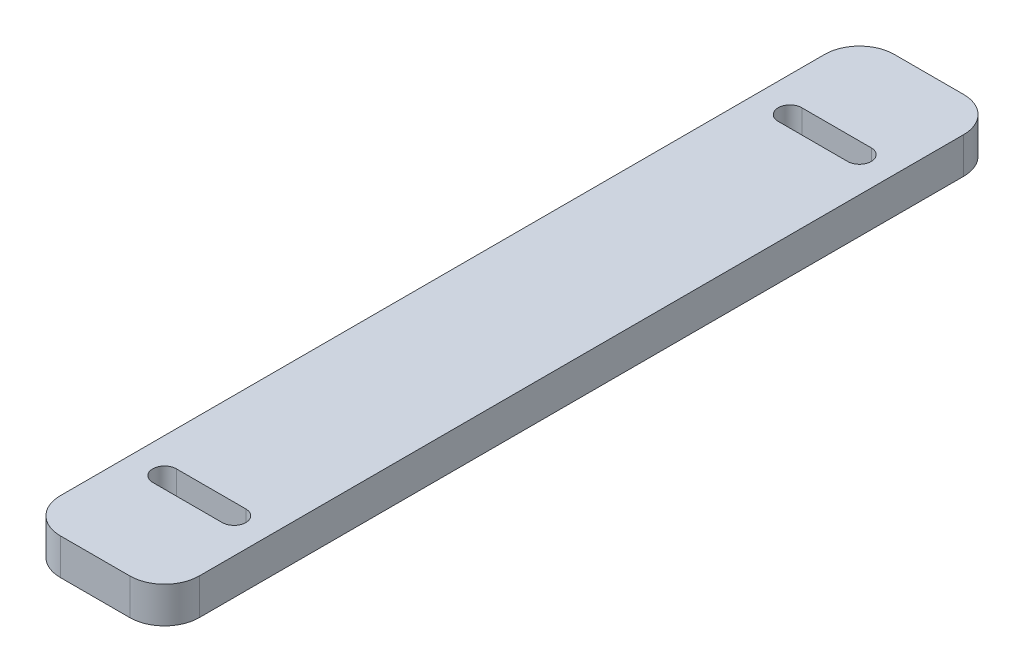
ISO-10303-21;
HEADER;
FILE_DESCRIPTION(('STEP AP214'),'2;1');
FILE_NAME('part.step','',(''),(''),'','','');
FILE_SCHEMA(('AUTOMOTIVE_DESIGN { 1 0 10303 214 1 1 1 1 }'));
ENDSEC;
DATA;
#1=APPLICATION_CONTEXT('core data for automotive mechanical design processes');
#2=APPLICATION_PROTOCOL_DEFINITION('international standard','automotive_design',2000,#1);
#3=PRODUCT_CONTEXT('',#1,'mechanical');
#4=PRODUCT('Part','Part','',(#3));
#5=PRODUCT_RELATED_PRODUCT_CATEGORY('part','',(#4));
#6=PRODUCT_DEFINITION_FORMATION('','',#4);
#7=PRODUCT_DEFINITION_CONTEXT('part definition',#1,'design');
#8=PRODUCT_DEFINITION('design','',#6,#7);
#9=PRODUCT_DEFINITION_SHAPE('','',#8);
#10=(LENGTH_UNIT() NAMED_UNIT(*) SI_UNIT(.MILLI.,.METRE.));
#11=(NAMED_UNIT(*) PLANE_ANGLE_UNIT() SI_UNIT($,.RADIAN.));
#12=(NAMED_UNIT(*) SI_UNIT($,.STERADIAN.) SOLID_ANGLE_UNIT());
#13=UNCERTAINTY_MEASURE_WITH_UNIT(LENGTH_MEASURE(1.E-05),#10,'distance_accuracy_value','');
#14=(GEOMETRIC_REPRESENTATION_CONTEXT(3) GLOBAL_UNCERTAINTY_ASSIGNED_CONTEXT((#13)) GLOBAL_UNIT_ASSIGNED_CONTEXT((#10,
#11,#12)) REPRESENTATION_CONTEXT('',''));
#15=CARTESIAN_POINT('',(0.,0.,0.));
#16=DIRECTION('',(0.,0.,1.));
#17=DIRECTION('',(1.,0.,0.));
#18=AXIS2_PLACEMENT_3D('',#15,#16,#17);
#19=CARTESIAN_POINT('',(-12.7,6.604,-76.2));
#20=DIRECTION('',(1.,0.,0.));
#21=DIRECTION('',(0.,0.,-1.));
#22=AXIS2_PLACEMENT_3D('',#19,#20,#21);
#23=PLANE('',#22);
#24=DIRECTION('',(0.,0.,1.));
#25=VECTOR('',#24,1.);
#26=CARTESIAN_POINT('',(-12.7,0.,-76.2));
#27=LINE('',#26,#25);
#28=CARTESIAN_POINT('',(-12.7,0.,-69.85));
#29=VERTEX_POINT('',#28);
#30=CARTESIAN_POINT('',(-12.7,0.,69.85));
#31=VERTEX_POINT('',#30);
#32=EDGE_CURVE('E214',#29,#31,#27,.T.);
#33=ORIENTED_EDGE('',*,*,#32,.T.);
#34=DIRECTION('',(0.,-1.,0.));
#35=VECTOR('',#34,1.);
#36=CARTESIAN_POINT('',(-12.7,6.604,69.85));
#37=LINE('',#36,#35);
#38=CARTESIAN_POINT('',(-12.7,6.604,69.85));
#39=VERTEX_POINT('',#38);
#40=EDGE_CURVE('E257',#31,#39,#37,.F.);
#41=ORIENTED_EDGE('',*,*,#40,.T.);
#42=DIRECTION('',(0.,0.,1.));
#43=VECTOR('',#42,1.);
#44=CARTESIAN_POINT('',(-12.7,6.604,-76.2));
#45=LINE('',#44,#43);
#46=CARTESIAN_POINT('',(-12.7,6.604,-69.85));
#47=VERTEX_POINT('',#46);
#48=EDGE_CURVE('E221',#47,#39,#45,.T.);
#49=ORIENTED_EDGE('',*,*,#48,.F.);
#50=DIRECTION('',(0.,-1.,0.));
#51=VECTOR('',#50,1.);
#52=CARTESIAN_POINT('',(-12.7,6.604,-69.85));
#53=LINE('',#52,#51);
#54=EDGE_CURVE('E254',#47,#29,#53,.T.);
#55=ORIENTED_EDGE('',*,*,#54,.T.);
#56=EDGE_LOOP('',(#33,#41,#49,#55));
#57=FACE_BOUND('',#56,.T.);
#58=ADVANCED_FACE('F32',(#57),#23,.F.);
#59=CARTESIAN_POINT('',(-12.7,6.604,76.2));
#60=DIRECTION('',(0.,0.,-1.));
#61=DIRECTION('',(-1.,0.,0.));
#62=AXIS2_PLACEMENT_3D('',#59,#60,#61);
#63=PLANE('',#62);
#64=DIRECTION('',(1.,0.,0.));
#65=VECTOR('',#64,1.);
#66=CARTESIAN_POINT('',(-12.7,6.604,76.2));
#67=LINE('',#66,#65);
#68=CARTESIAN_POINT('',(-6.34999999999999,6.604,76.2));
#69=VERTEX_POINT('',#68);
#70=CARTESIAN_POINT('',(6.35000000000001,6.604,76.2));
#71=VERTEX_POINT('',#70);
#72=EDGE_CURVE('E224',#69,#71,#67,.T.);
#73=ORIENTED_EDGE('',*,*,#72,.F.);
#74=DIRECTION('',(0.,-1.,0.));
#75=VECTOR('',#74,1.);
#76=CARTESIAN_POINT('',(-6.34999999999999,6.604,76.2));
#77=LINE('',#76,#75);
#78=CARTESIAN_POINT('',(-6.34999999999999,0.,76.2));
#79=VERTEX_POINT('',#78);
#80=EDGE_CURVE('E243',#69,#79,#77,.T.);
#81=ORIENTED_EDGE('',*,*,#80,.T.);
#82=DIRECTION('',(1.,0.,0.));
#83=VECTOR('',#82,1.);
#84=CARTESIAN_POINT('',(-12.7,0.,76.2));
#85=LINE('',#84,#83);
#86=CARTESIAN_POINT('',(6.35000000000001,0.,76.2));
#87=VERTEX_POINT('',#86);
#88=EDGE_CURVE('E235',#79,#87,#85,.T.);
#89=ORIENTED_EDGE('',*,*,#88,.T.);
#90=DIRECTION('',(0.,-1.,0.));
#91=VECTOR('',#90,1.);
#92=CARTESIAN_POINT('',(6.35000000000001,6.604,76.2));
#93=LINE('',#92,#91);
#94=EDGE_CURVE('E232',#87,#71,#93,.F.);
#95=ORIENTED_EDGE('',*,*,#94,.T.);
#96=EDGE_LOOP('',(#73,#81,#89,#95));
#97=FACE_BOUND('',#96,.T.);
#98=ADVANCED_FACE('F293',(#97),#63,.F.);
#99=CARTESIAN_POINT('',(12.7,6.604,-76.2));
#100=DIRECTION('',(-1.,0.,0.));
#101=DIRECTION('',(0.,0.,1.));
#102=AXIS2_PLACEMENT_3D('',#99,#100,#101);
#103=PLANE('',#102);
#104=DIRECTION('',(0.,0.,-1.));
#105=VECTOR('',#104,1.);
#106=CARTESIAN_POINT('',(12.7,6.604,-76.2));
#107=LINE('',#106,#105);
#108=CARTESIAN_POINT('',(12.7,6.604,69.85));
#109=VERTEX_POINT('',#108);
#110=CARTESIAN_POINT('',(12.7,6.604,-69.85));
#111=VERTEX_POINT('',#110);
#112=EDGE_CURVE('E228',#109,#111,#107,.T.);
#113=ORIENTED_EDGE('',*,*,#112,.F.);
#114=DIRECTION('',(0.,-1.,0.));
#115=VECTOR('',#114,1.);
#116=CARTESIAN_POINT('',(12.7,6.604,69.85));
#117=LINE('',#116,#115);
#118=CARTESIAN_POINT('',(12.7,0.,69.85));
#119=VERTEX_POINT('',#118);
#120=EDGE_CURVE('E268',#109,#119,#117,.T.);
#121=ORIENTED_EDGE('',*,*,#120,.T.);
#122=DIRECTION('',(0.,0.,-1.));
#123=VECTOR('',#122,1.);
#124=CARTESIAN_POINT('',(12.7,0.,-76.2));
#125=LINE('',#124,#123);
#126=CARTESIAN_POINT('',(12.7,0.,-69.85));
#127=VERTEX_POINT('',#126);
#128=EDGE_CURVE('E238',#119,#127,#125,.T.);
#129=ORIENTED_EDGE('',*,*,#128,.T.);
#130=DIRECTION('',(0.,-1.,0.));
#131=VECTOR('',#130,1.);
#132=CARTESIAN_POINT('',(12.7,6.604,-69.85));
#133=LINE('',#132,#131);
#134=EDGE_CURVE('E266',#127,#111,#133,.F.);
#135=ORIENTED_EDGE('',*,*,#134,.T.);
#136=EDGE_LOOP('',(#113,#121,#129,#135));
#137=FACE_BOUND('',#136,.T.);
#138=ADVANCED_FACE('F301',(#137),#103,.F.);
#139=CARTESIAN_POINT('',(-12.7,6.604,-76.2));
#140=DIRECTION('',(0.,0.,1.));
#141=DIRECTION('',(1.,0.,0.));
#142=AXIS2_PLACEMENT_3D('',#139,#140,#141);
#143=PLANE('',#142);
#144=DIRECTION('',(-1.,0.,0.));
#145=VECTOR('',#144,1.);
#146=CARTESIAN_POINT('',(-12.7,0.,-76.2));
#147=LINE('',#146,#145);
#148=CARTESIAN_POINT('',(6.34999999999999,0.,-76.2));
#149=VERTEX_POINT('',#148);
#150=CARTESIAN_POINT('',(-6.35000000000001,0.,-76.2));
#151=VERTEX_POINT('',#150);
#152=EDGE_CURVE('E225',#149,#151,#147,.T.);
#153=ORIENTED_EDGE('',*,*,#152,.T.);
#154=DIRECTION('',(0.,-1.,0.));
#155=VECTOR('',#154,1.);
#156=CARTESIAN_POINT('',(-6.35000000000001,6.604,-76.2));
#157=LINE('',#156,#155);
#158=CARTESIAN_POINT('',(-6.35000000000001,6.604,-76.2));
#159=VERTEX_POINT('',#158);
#160=EDGE_CURVE('E11',#151,#159,#157,.F.);
#161=ORIENTED_EDGE('',*,*,#160,.T.);
#162=DIRECTION('',(-1.,0.,0.));
#163=VECTOR('',#162,1.);
#164=CARTESIAN_POINT('',(-12.7,6.604,-76.2));
#165=LINE('',#164,#163);
#166=CARTESIAN_POINT('',(6.34999999999999,6.604,-76.2));
#167=VERTEX_POINT('',#166);
#168=EDGE_CURVE('E230',#167,#159,#165,.T.);
#169=ORIENTED_EDGE('',*,*,#168,.F.);
#170=DIRECTION('',(0.,-1.,0.));
#171=VECTOR('',#170,1.);
#172=CARTESIAN_POINT('',(6.34999999999999,6.604,-76.2));
#173=LINE('',#172,#171);
#174=EDGE_CURVE('E40',#167,#149,#173,.T.);
#175=ORIENTED_EDGE('',*,*,#174,.T.);
#176=EDGE_LOOP('',(#153,#161,#169,#175));
#177=FACE_BOUND('',#176,.T.);
#178=ADVANCED_FACE('F273',(#177),#143,.F.);
#179=CARTESIAN_POINT('',(0.,6.604,0.));
#180=DIRECTION('',(0.,1.,0.));
#181=DIRECTION('',(0.,0.,1.));
#182=AXIS2_PLACEMENT_3D('',#179,#180,#181);
#183=PLANE('',#182);
#184=CARTESIAN_POINT('',(-6.34999999999999,6.604,57.15));
#185=DIRECTION('',(0.,1.,0.));
#186=DIRECTION('',(0.,0.,1.));
#187=AXIS2_PLACEMENT_3D('',#184,#185,#186);
#188=CIRCLE('',#187,2.159);
#189=CARTESIAN_POINT('',(-6.34999999999999,6.604,54.991));
#190=VERTEX_POINT('',#189);
#191=CARTESIAN_POINT('',(-6.34999999999999,6.604,59.309));
#192=VERTEX_POINT('',#191);
#193=EDGE_CURVE('E152',#190,#192,#188,.T.);
#194=ORIENTED_EDGE('',*,*,#193,.F.);
#195=DIRECTION('',(-1.,0.,0.));
#196=VECTOR('',#195,1.);
#197=CARTESIAN_POINT('',(-6.34999999999999,6.604,54.991));
#198=LINE('',#197,#196);
#199=CARTESIAN_POINT('',(6.35000000000001,6.604,54.991));
#200=VERTEX_POINT('',#199);
#201=EDGE_CURVE('E170',#200,#190,#198,.T.);
#202=ORIENTED_EDGE('',*,*,#201,.F.);
#203=CARTESIAN_POINT('',(6.35000000000001,6.604,57.15));
#204=DIRECTION('',(0.,1.,0.));
#205=DIRECTION('',(0.,0.,1.));
#206=AXIS2_PLACEMENT_3D('',#203,#204,#205);
#207=CIRCLE('',#206,2.159);
#208=CARTESIAN_POINT('',(6.35000000000001,6.604,59.309));
#209=VERTEX_POINT('',#208);
#210=EDGE_CURVE('E173',#209,#200,#207,.T.);
#211=ORIENTED_EDGE('',*,*,#210,.F.);
#212=DIRECTION('',(1.,0.,0.));
#213=VECTOR('',#212,1.);
#214=CARTESIAN_POINT('',(-6.34999999999999,6.604,59.309));
#215=LINE('',#214,#213);
#216=EDGE_CURVE('E179',#192,#209,#215,.T.);
#217=ORIENTED_EDGE('',*,*,#216,.F.);
#218=EDGE_LOOP('',(#194,#202,#211,#217));
#219=FACE_BOUND('',#218,.T.);
#220=CARTESIAN_POINT('',(-6.35,6.604,-57.15));
#221=DIRECTION('',(0.,1.,0.));
#222=DIRECTION('',(0.,0.,1.));
#223=AXIS2_PLACEMENT_3D('',#220,#221,#222);
#224=CIRCLE('',#223,2.159);
#225=CARTESIAN_POINT('',(-6.35,6.604,-59.309));
#226=VERTEX_POINT('',#225);
#227=CARTESIAN_POINT('',(-6.35,6.604,-54.991));
#228=VERTEX_POINT('',#227);
#229=EDGE_CURVE('E185',#226,#228,#224,.T.);
#230=ORIENTED_EDGE('',*,*,#229,.F.);
#231=DIRECTION('',(-1.,0.,0.));
#232=VECTOR('',#231,1.);
#233=CARTESIAN_POINT('',(-6.35,6.604,-59.309));
#234=LINE('',#233,#232);
#235=CARTESIAN_POINT('',(6.35,6.604,-59.309));
#236=VERTEX_POINT('',#235);
#237=EDGE_CURVE('E193',#236,#226,#234,.T.);
#238=ORIENTED_EDGE('',*,*,#237,.F.);
#239=CARTESIAN_POINT('',(6.35,6.604,-57.15));
#240=DIRECTION('',(0.,1.,0.));
#241=DIRECTION('',(0.,0.,1.));
#242=AXIS2_PLACEMENT_3D('',#239,#240,#241);
#243=CIRCLE('',#242,2.159);
#244=CARTESIAN_POINT('',(6.35,6.604,-54.991));
#245=VERTEX_POINT('',#244);
#246=EDGE_CURVE('E207',#245,#236,#243,.T.);
#247=ORIENTED_EDGE('',*,*,#246,.F.);
#248=DIRECTION('',(1.,0.,0.));
#249=VECTOR('',#248,1.);
#250=CARTESIAN_POINT('',(-6.35,6.604,-54.991));
#251=LINE('',#250,#249);
#252=EDGE_CURVE('E204',#228,#245,#251,.T.);
#253=ORIENTED_EDGE('',*,*,#252,.F.);
#254=EDGE_LOOP('',(#230,#238,#247,#253));
#255=FACE_BOUND('',#254,.T.);
#256=ORIENTED_EDGE('',*,*,#48,.T.);
#257=CARTESIAN_POINT('',(-6.34999999999999,6.604,69.85));
#258=DIRECTION('',(0.,1.,0.));
#259=DIRECTION('',(0.,0.,1.));
#260=AXIS2_PLACEMENT_3D('',#257,#258,#259);
#261=CIRCLE('',#260,6.35);
#262=EDGE_CURVE('E264',#39,#69,#261,.T.);
#263=ORIENTED_EDGE('',*,*,#262,.T.);
#264=ORIENTED_EDGE('',*,*,#72,.T.);
#265=CARTESIAN_POINT('',(6.35000000000001,6.604,69.85));
#266=DIRECTION('',(0.,1.,0.));
#267=DIRECTION('',(0.,0.,1.));
#268=AXIS2_PLACEMENT_3D('',#265,#266,#267);
#269=CIRCLE('',#268,6.35);
#270=EDGE_CURVE('E262',#71,#109,#269,.T.);
#271=ORIENTED_EDGE('',*,*,#270,.T.);
#272=ORIENTED_EDGE('',*,*,#112,.T.);
#273=CARTESIAN_POINT('',(6.34999999999999,6.604,-69.85));
#274=DIRECTION('',(0.,1.,0.));
#275=DIRECTION('',(0.,0.,1.));
#276=AXIS2_PLACEMENT_3D('',#273,#274,#275);
#277=CIRCLE('',#276,6.35);
#278=EDGE_CURVE('E52',#111,#167,#277,.T.);
#279=ORIENTED_EDGE('',*,*,#278,.T.);
#280=ORIENTED_EDGE('',*,*,#168,.T.);
#281=CARTESIAN_POINT('',(-6.35000000000001,6.604,-69.85));
#282=DIRECTION('',(0.,1.,0.));
#283=DIRECTION('',(0.,0.,1.));
#284=AXIS2_PLACEMENT_3D('',#281,#282,#283);
#285=CIRCLE('',#284,6.35);
#286=EDGE_CURVE('E260',#159,#47,#285,.T.);
#287=ORIENTED_EDGE('',*,*,#286,.T.);
#288=EDGE_LOOP('',(#256,#263,#264,#271,#272,#279,#280,#287));
#289=FACE_BOUND('',#288,.T.);
#290=ADVANCED_FACE('F287',(#219,#255,#289),#183,.T.);
#291=CARTESIAN_POINT('',(0.,0.,0.));
#292=DIRECTION('',(0.,1.,0.));
#293=DIRECTION('',(0.,0.,1.));
#294=AXIS2_PLACEMENT_3D('',#291,#292,#293);
#295=PLANE('',#294);
#296=DIRECTION('',(-1.,0.,0.));
#297=VECTOR('',#296,1.);
#298=CARTESIAN_POINT('',(-6.34999999999999,0.,54.991));
#299=LINE('',#298,#297);
#300=CARTESIAN_POINT('',(6.35000000000001,0.,54.991));
#301=VERTEX_POINT('',#300);
#302=CARTESIAN_POINT('',(-6.34999999999999,0.,54.991));
#303=VERTEX_POINT('',#302);
#304=EDGE_CURVE('E157',#301,#303,#299,.T.);
#305=ORIENTED_EDGE('',*,*,#304,.T.);
#306=CARTESIAN_POINT('',(-6.34999999999999,0.,57.15));
#307=DIRECTION('',(0.,1.,0.));
#308=DIRECTION('',(0.,0.,1.));
#309=AXIS2_PLACEMENT_3D('',#306,#307,#308);
#310=CIRCLE('',#309,2.159);
#311=CARTESIAN_POINT('',(-6.34999999999999,0.,59.309));
#312=VERTEX_POINT('',#311);
#313=EDGE_CURVE('E149',#303,#312,#310,.T.);
#314=ORIENTED_EDGE('',*,*,#313,.T.);
#315=DIRECTION('',(1.,0.,0.));
#316=VECTOR('',#315,1.);
#317=CARTESIAN_POINT('',(-6.34999999999999,0.,59.309));
#318=LINE('',#317,#316);
#319=CARTESIAN_POINT('',(6.35000000000001,0.,59.309));
#320=VERTEX_POINT('',#319);
#321=EDGE_CURVE('E161',#312,#320,#318,.T.);
#322=ORIENTED_EDGE('',*,*,#321,.T.);
#323=CARTESIAN_POINT('',(6.35000000000001,0.,57.15));
#324=DIRECTION('',(0.,1.,0.));
#325=DIRECTION('',(0.,0.,1.));
#326=AXIS2_PLACEMENT_3D('',#323,#324,#325);
#327=CIRCLE('',#326,2.159);
#328=EDGE_CURVE('E165',#320,#301,#327,.T.);
#329=ORIENTED_EDGE('',*,*,#328,.T.);
#330=EDGE_LOOP('',(#305,#314,#322,#329));
#331=FACE_BOUND('',#330,.T.);
#332=DIRECTION('',(-1.,0.,0.));
#333=VECTOR('',#332,1.);
#334=CARTESIAN_POINT('',(-6.35,0.,-59.309));
#335=LINE('',#334,#333);
#336=CARTESIAN_POINT('',(6.35,0.,-59.309));
#337=VERTEX_POINT('',#336);
#338=CARTESIAN_POINT('',(-6.35,0.,-59.309));
#339=VERTEX_POINT('',#338);
#340=EDGE_CURVE('E199',#337,#339,#335,.T.);
#341=ORIENTED_EDGE('',*,*,#340,.T.);
#342=CARTESIAN_POINT('',(-6.35,0.,-57.15));
#343=DIRECTION('',(0.,1.,0.));
#344=DIRECTION('',(0.,0.,1.));
#345=AXIS2_PLACEMENT_3D('',#342,#343,#344);
#346=CIRCLE('',#345,2.159);
#347=CARTESIAN_POINT('',(-6.35,0.,-54.991));
#348=VERTEX_POINT('',#347);
#349=EDGE_CURVE('E189',#339,#348,#346,.T.);
#350=ORIENTED_EDGE('',*,*,#349,.T.);
#351=DIRECTION('',(1.,0.,0.));
#352=VECTOR('',#351,1.);
#353=CARTESIAN_POINT('',(-6.35,0.,-54.991));
#354=LINE('',#353,#352);
#355=CARTESIAN_POINT('',(6.35,0.,-54.991));
#356=VERTEX_POINT('',#355);
#357=EDGE_CURVE('E192',#348,#356,#354,.T.);
#358=ORIENTED_EDGE('',*,*,#357,.T.);
#359=CARTESIAN_POINT('',(6.35,0.,-57.15));
#360=DIRECTION('',(0.,1.,0.));
#361=DIRECTION('',(0.,0.,1.));
#362=AXIS2_PLACEMENT_3D('',#359,#360,#361);
#363=CIRCLE('',#362,2.159);
#364=EDGE_CURVE('E196',#356,#337,#363,.T.);
#365=ORIENTED_EDGE('',*,*,#364,.T.);
#366=EDGE_LOOP('',(#341,#350,#358,#365));
#367=FACE_BOUND('',#366,.T.);
#368=ORIENTED_EDGE('',*,*,#88,.F.);
#369=CARTESIAN_POINT('',(-6.34999999999999,0.,69.85));
#370=DIRECTION('',(0.,1.,0.));
#371=DIRECTION('',(0.,0.,1.));
#372=AXIS2_PLACEMENT_3D('',#369,#370,#371);
#373=CIRCLE('',#372,6.35);
#374=EDGE_CURVE('E252',#79,#31,#373,.F.);
#375=ORIENTED_EDGE('',*,*,#374,.T.);
#376=ORIENTED_EDGE('',*,*,#32,.F.);
#377=CARTESIAN_POINT('',(-6.35000000000001,0.,-69.85));
#378=DIRECTION('',(0.,1.,0.));
#379=DIRECTION('',(0.,0.,1.));
#380=AXIS2_PLACEMENT_3D('',#377,#378,#379);
#381=CIRCLE('',#380,6.35);
#382=EDGE_CURVE('E248',#29,#151,#381,.F.);
#383=ORIENTED_EDGE('',*,*,#382,.T.);
#384=ORIENTED_EDGE('',*,*,#152,.F.);
#385=CARTESIAN_POINT('',(6.34999999999999,0.,-69.85));
#386=DIRECTION('',(0.,1.,0.));
#387=DIRECTION('',(0.,0.,1.));
#388=AXIS2_PLACEMENT_3D('',#385,#386,#387);
#389=CIRCLE('',#388,6.35);
#390=EDGE_CURVE('E246',#149,#127,#389,.F.);
#391=ORIENTED_EDGE('',*,*,#390,.T.);
#392=ORIENTED_EDGE('',*,*,#128,.F.);
#393=CARTESIAN_POINT('',(6.35000000000001,0.,69.85));
#394=DIRECTION('',(0.,1.,0.));
#395=DIRECTION('',(0.,0.,1.));
#396=AXIS2_PLACEMENT_3D('',#393,#394,#395);
#397=CIRCLE('',#396,6.35);
#398=EDGE_CURVE('E250',#119,#87,#397,.F.);
#399=ORIENTED_EDGE('',*,*,#398,.T.);
#400=EDGE_LOOP('',(#368,#375,#376,#383,#384,#391,#392,#399));
#401=FACE_BOUND('',#400,.T.);
#402=ADVANCED_FACE('F167',(#331,#367,#401),#295,.F.);
#403=CARTESIAN_POINT('',(-6.35,0.,-57.15));
#404=DIRECTION('',(0.,1.,0.));
#405=DIRECTION('',(0.,0.,1.));
#406=AXIS2_PLACEMENT_3D('',#403,#404,#405);
#407=CYLINDRICAL_SURFACE('',#406,2.159);
#408=ORIENTED_EDGE('',*,*,#229,.T.);
#409=DIRECTION('',(0.,1.,0.));
#410=VECTOR('',#409,1.);
#411=CARTESIAN_POINT('',(-6.35,0.,-54.991));
#412=LINE('',#411,#410);
#413=EDGE_CURVE('E202',#348,#228,#412,.T.);
#414=ORIENTED_EDGE('',*,*,#413,.F.);
#415=ORIENTED_EDGE('',*,*,#349,.F.);
#416=DIRECTION('',(0.,1.,0.));
#417=VECTOR('',#416,1.);
#418=CARTESIAN_POINT('',(-6.35,0.,-59.309));
#419=LINE('',#418,#417);
#420=EDGE_CURVE('E212',#339,#226,#419,.T.);
#421=ORIENTED_EDGE('',*,*,#420,.T.);
#422=EDGE_LOOP('',(#408,#414,#415,#421));
#423=FACE_BOUND('',#422,.T.);
#424=ADVANCED_FACE('F398',(#423),#407,.F.);
#425=CARTESIAN_POINT('',(-6.35,0.,-59.309));
#426=DIRECTION('',(0.,0.,-1.));
#427=DIRECTION('',(-1.,0.,0.));
#428=AXIS2_PLACEMENT_3D('',#425,#426,#427);
#429=PLANE('',#428);
#430=ORIENTED_EDGE('',*,*,#237,.T.);
#431=ORIENTED_EDGE('',*,*,#420,.F.);
#432=ORIENTED_EDGE('',*,*,#340,.F.);
#433=DIRECTION('',(0.,1.,0.));
#434=VECTOR('',#433,1.);
#435=CARTESIAN_POINT('',(6.35,0.,-59.309));
#436=LINE('',#435,#434);
#437=EDGE_CURVE('E215',#337,#236,#436,.T.);
#438=ORIENTED_EDGE('',*,*,#437,.T.);
#439=EDGE_LOOP('',(#430,#431,#432,#438));
#440=FACE_BOUND('',#439,.T.);
#441=ADVANCED_FACE('F389',(#440),#429,.F.);
#442=CARTESIAN_POINT('',(6.35,0.,-57.15));
#443=DIRECTION('',(0.,1.,0.));
#444=DIRECTION('',(0.,0.,1.));
#445=AXIS2_PLACEMENT_3D('',#442,#443,#444);
#446=CYLINDRICAL_SURFACE('',#445,2.159);
#447=ORIENTED_EDGE('',*,*,#246,.T.);
#448=ORIENTED_EDGE('',*,*,#437,.F.);
#449=ORIENTED_EDGE('',*,*,#364,.F.);
#450=DIRECTION('',(0.,1.,0.));
#451=VECTOR('',#450,1.);
#452=CARTESIAN_POINT('',(6.35,0.,-54.991));
#453=LINE('',#452,#451);
#454=EDGE_CURVE('E217',#356,#245,#453,.T.);
#455=ORIENTED_EDGE('',*,*,#454,.T.);
#456=EDGE_LOOP('',(#447,#448,#449,#455));
#457=FACE_BOUND('',#456,.T.);
#458=ADVANCED_FACE('F380',(#457),#446,.F.);
#459=CARTESIAN_POINT('',(-6.35,0.,-54.991));
#460=DIRECTION('',(0.,0.,1.));
#461=DIRECTION('',(1.,0.,0.));
#462=AXIS2_PLACEMENT_3D('',#459,#460,#461);
#463=PLANE('',#462);
#464=ORIENTED_EDGE('',*,*,#252,.T.);
#465=ORIENTED_EDGE('',*,*,#454,.F.);
#466=ORIENTED_EDGE('',*,*,#357,.F.);
#467=ORIENTED_EDGE('',*,*,#413,.T.);
#468=EDGE_LOOP('',(#464,#465,#466,#467));
#469=FACE_BOUND('',#468,.T.);
#470=ADVANCED_FACE('F372',(#469),#463,.F.);
#471=CARTESIAN_POINT('',(-6.34999999999999,0.,57.15));
#472=DIRECTION('',(0.,1.,0.));
#473=DIRECTION('',(0.,0.,1.));
#474=AXIS2_PLACEMENT_3D('',#471,#472,#473);
#475=CYLINDRICAL_SURFACE('',#474,2.159);
#476=ORIENTED_EDGE('',*,*,#193,.T.);
#477=DIRECTION('',(0.,1.,0.));
#478=VECTOR('',#477,1.);
#479=CARTESIAN_POINT('',(-6.34999999999999,0.,59.309));
#480=LINE('',#479,#478);
#481=EDGE_CURVE('E145',#312,#192,#480,.T.);
#482=ORIENTED_EDGE('',*,*,#481,.F.);
#483=ORIENTED_EDGE('',*,*,#313,.F.);
#484=DIRECTION('',(0.,1.,0.));
#485=VECTOR('',#484,1.);
#486=CARTESIAN_POINT('',(-6.34999999999999,0.,54.991));
#487=LINE('',#486,#485);
#488=EDGE_CURVE('E183',#303,#190,#487,.T.);
#489=ORIENTED_EDGE('',*,*,#488,.T.);
#490=EDGE_LOOP('',(#476,#482,#483,#489));
#491=FACE_BOUND('',#490,.T.);
#492=ADVANCED_FACE('F147',(#491),#475,.F.);
#493=CARTESIAN_POINT('',(-6.34999999999999,0.,54.991));
#494=DIRECTION('',(0.,0.,-1.));
#495=DIRECTION('',(-1.,0.,0.));
#496=AXIS2_PLACEMENT_3D('',#493,#494,#495);
#497=PLANE('',#496);
#498=ORIENTED_EDGE('',*,*,#201,.T.);
#499=ORIENTED_EDGE('',*,*,#488,.F.);
#500=ORIENTED_EDGE('',*,*,#304,.F.);
#501=DIRECTION('',(0.,1.,0.));
#502=VECTOR('',#501,1.);
#503=CARTESIAN_POINT('',(6.35000000000001,0.,54.991));
#504=LINE('',#503,#502);
#505=EDGE_CURVE('E186',#301,#200,#504,.T.);
#506=ORIENTED_EDGE('',*,*,#505,.T.);
#507=EDGE_LOOP('',(#498,#499,#500,#506));
#508=FACE_BOUND('',#507,.T.);
#509=ADVANCED_FACE('F355',(#508),#497,.F.);
#510=CARTESIAN_POINT('',(6.35000000000001,0.,57.15));
#511=DIRECTION('',(0.,1.,0.));
#512=DIRECTION('',(0.,0.,1.));
#513=AXIS2_PLACEMENT_3D('',#510,#511,#512);
#514=CYLINDRICAL_SURFACE('',#513,2.159);
#515=ORIENTED_EDGE('',*,*,#210,.T.);
#516=ORIENTED_EDGE('',*,*,#505,.F.);
#517=ORIENTED_EDGE('',*,*,#328,.F.);
#518=DIRECTION('',(0.,1.,0.));
#519=VECTOR('',#518,1.);
#520=CARTESIAN_POINT('',(6.35000000000001,0.,59.309));
#521=LINE('',#520,#519);
#522=EDGE_CURVE('E156',#320,#209,#521,.T.);
#523=ORIENTED_EDGE('',*,*,#522,.T.);
#524=EDGE_LOOP('',(#515,#516,#517,#523));
#525=FACE_BOUND('',#524,.T.);
#526=ADVANCED_FACE('F347',(#525),#514,.F.);
#527=CARTESIAN_POINT('',(-6.34999999999999,0.,59.309));
#528=DIRECTION('',(0.,0.,1.));
#529=DIRECTION('',(1.,0.,0.));
#530=AXIS2_PLACEMENT_3D('',#527,#528,#529);
#531=PLANE('',#530);
#532=ORIENTED_EDGE('',*,*,#216,.T.);
#533=ORIENTED_EDGE('',*,*,#522,.F.);
#534=ORIENTED_EDGE('',*,*,#321,.F.);
#535=ORIENTED_EDGE('',*,*,#481,.T.);
#536=EDGE_LOOP('',(#532,#533,#534,#535));
#537=FACE_BOUND('',#536,.T.);
#538=ADVANCED_FACE('F162',(#537),#531,.F.);
#539=CARTESIAN_POINT('',(-6.34999999999999,6.604,69.85));
#540=DIRECTION('',(0.,-1.,0.));
#541=DIRECTION('',(0.,0.,-1.));
#542=AXIS2_PLACEMENT_3D('',#539,#540,#541);
#543=CYLINDRICAL_SURFACE('',#542,6.35);
#544=ORIENTED_EDGE('',*,*,#262,.F.);
#545=ORIENTED_EDGE('',*,*,#40,.F.);
#546=ORIENTED_EDGE('',*,*,#374,.F.);
#547=ORIENTED_EDGE('',*,*,#80,.F.);
#548=EDGE_LOOP('',(#544,#545,#546,#547));
#549=FACE_BOUND('',#548,.T.);
#550=ADVANCED_FACE('F291',(#549),#543,.T.);
#551=CARTESIAN_POINT('',(6.35000000000001,6.604,69.85));
#552=DIRECTION('',(0.,-1.,0.));
#553=DIRECTION('',(0.,0.,-1.));
#554=AXIS2_PLACEMENT_3D('',#551,#552,#553);
#555=CYLINDRICAL_SURFACE('',#554,6.35);
#556=ORIENTED_EDGE('',*,*,#270,.F.);
#557=ORIENTED_EDGE('',*,*,#94,.F.);
#558=ORIENTED_EDGE('',*,*,#398,.F.);
#559=ORIENTED_EDGE('',*,*,#120,.F.);
#560=EDGE_LOOP('',(#556,#557,#558,#559));
#561=FACE_BOUND('',#560,.T.);
#562=ADVANCED_FACE('F298',(#561),#555,.T.);
#563=CARTESIAN_POINT('',(-6.35000000000001,6.604,-69.85));
#564=DIRECTION('',(0.,-1.,0.));
#565=DIRECTION('',(0.,0.,-1.));
#566=AXIS2_PLACEMENT_3D('',#563,#564,#565);
#567=CYLINDRICAL_SURFACE('',#566,6.35);
#568=ORIENTED_EDGE('',*,*,#286,.F.);
#569=ORIENTED_EDGE('',*,*,#160,.F.);
#570=ORIENTED_EDGE('',*,*,#382,.F.);
#571=ORIENTED_EDGE('',*,*,#54,.F.);
#572=EDGE_LOOP('',(#568,#569,#570,#571));
#573=FACE_BOUND('',#572,.T.);
#574=ADVANCED_FACE('F282',(#573),#567,.T.);
#575=CARTESIAN_POINT('',(6.34999999999999,6.604,-69.85));
#576=DIRECTION('',(0.,-1.,0.));
#577=DIRECTION('',(0.,0.,-1.));
#578=AXIS2_PLACEMENT_3D('',#575,#576,#577);
#579=CYLINDRICAL_SURFACE('',#578,6.35);
#580=ORIENTED_EDGE('',*,*,#278,.F.);
#581=ORIENTED_EDGE('',*,*,#134,.F.);
#582=ORIENTED_EDGE('',*,*,#390,.F.);
#583=ORIENTED_EDGE('',*,*,#174,.F.);
#584=EDGE_LOOP('',(#580,#581,#582,#583));
#585=FACE_BOUND('',#584,.T.);
#586=ADVANCED_FACE('F34',(#585),#579,.T.);
#587=CLOSED_SHELL('',(#58,#98,#138,#178,#290,#402,#424,#441,#458,#470,#492,#509,#526,#538,#550,
#562,#574,#586));
#588=MANIFOLD_SOLID_BREP('B2',#587);
#589=ADVANCED_BREP_SHAPE_REPRESENTATION('',(#18,#588),#14);
#590=SHAPE_DEFINITION_REPRESENTATION(#9,#589);
ENDSEC;
END-ISO-10303-21;
